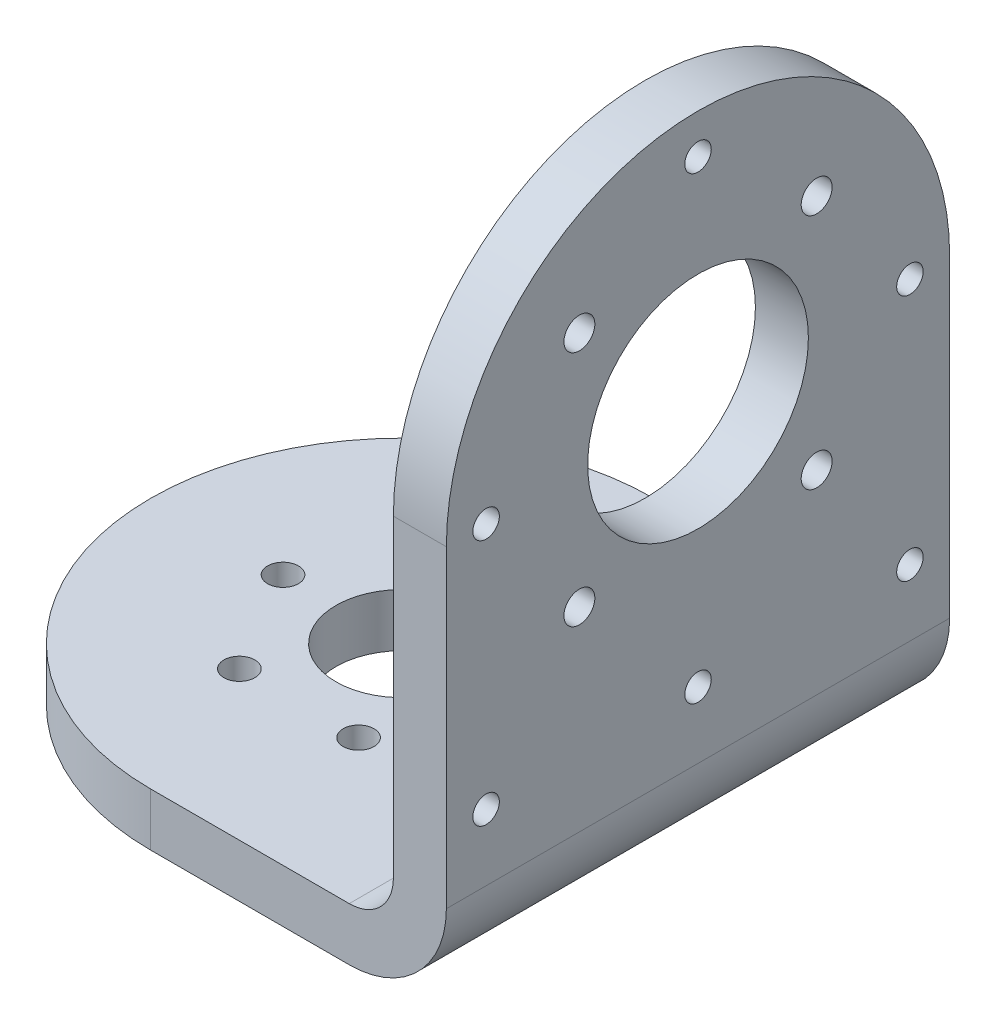
ISO-10303-21;
HEADER;
FILE_DESCRIPTION(('STEP AP214'),'2;1');
FILE_NAME('part.step','',(''),(''),'','','');
FILE_SCHEMA(('AUTOMOTIVE_DESIGN { 1 0 10303 214 1 1 1 1 }'));
ENDSEC;
DATA;
#1=APPLICATION_CONTEXT('core data for automotive mechanical design processes');
#2=APPLICATION_PROTOCOL_DEFINITION('international standard','automotive_design',2000,#1);
#3=PRODUCT_CONTEXT('',#1,'mechanical');
#4=PRODUCT('Part','Part','',(#3));
#5=PRODUCT_RELATED_PRODUCT_CATEGORY('part','',(#4));
#6=PRODUCT_DEFINITION_FORMATION('','',#4);
#7=PRODUCT_DEFINITION_CONTEXT('part definition',#1,'design');
#8=PRODUCT_DEFINITION('design','',#6,#7);
#9=PRODUCT_DEFINITION_SHAPE('','',#8);
#10=(LENGTH_UNIT() NAMED_UNIT(*) SI_UNIT(.MILLI.,.METRE.));
#11=(NAMED_UNIT(*) PLANE_ANGLE_UNIT() SI_UNIT($,.RADIAN.));
#12=(NAMED_UNIT(*) SI_UNIT($,.STERADIAN.) SOLID_ANGLE_UNIT());
#13=UNCERTAINTY_MEASURE_WITH_UNIT(LENGTH_MEASURE(1.E-05),#10,'distance_accuracy_value','');
#14=(GEOMETRIC_REPRESENTATION_CONTEXT(3) GLOBAL_UNCERTAINTY_ASSIGNED_CONTEXT((#13)) GLOBAL_UNIT_ASSIGNED_CONTEXT((#10,
#11,#12)) REPRESENTATION_CONTEXT('',''));
#15=CARTESIAN_POINT('',(0.,0.,0.));
#16=DIRECTION('',(0.,0.,1.));
#17=DIRECTION('',(1.,0.,0.));
#18=AXIS2_PLACEMENT_3D('',#15,#16,#17);
#19=CARTESIAN_POINT('',(0.,6.,0.));
#20=DIRECTION('',(0.,-1.,0.));
#21=DIRECTION('',(0.,0.,-1.));
#22=AXIS2_PLACEMENT_3D('',#19,#20,#21);
#23=CYLINDRICAL_SURFACE('',#22,28.5);
#24=CARTESIAN_POINT('',(0.,0.,0.));
#25=DIRECTION('',(0.,1.,0.));
#26=DIRECTION('',(0.,0.,1.));
#27=AXIS2_PLACEMENT_3D('',#24,#25,#26);
#28=CIRCLE('',#27,28.5);
#29=CARTESIAN_POINT('',(0.,0.,-28.5));
#30=VERTEX_POINT('',#29);
#31=CARTESIAN_POINT('',(0.,0.,28.5));
#32=VERTEX_POINT('',#31);
#33=EDGE_CURVE('E138',#30,#32,#28,.T.);
#34=ORIENTED_EDGE('',*,*,#33,.T.);
#35=DIRECTION('',(0.,-1.,0.));
#36=VECTOR('',#35,1.);
#37=CARTESIAN_POINT('',(0.,6.,28.5));
#38=LINE('',#37,#36);
#39=CARTESIAN_POINT('',(0.,6.,28.5));
#40=VERTEX_POINT('',#39);
#41=EDGE_CURVE('E161',#40,#32,#38,.T.);
#42=ORIENTED_EDGE('',*,*,#41,.F.);
#43=CARTESIAN_POINT('',(0.,6.,0.));
#44=DIRECTION('',(0.,1.,0.));
#45=DIRECTION('',(0.,0.,1.));
#46=AXIS2_PLACEMENT_3D('',#43,#44,#45);
#47=CIRCLE('',#46,28.5);
#48=CARTESIAN_POINT('',(0.,6.,-28.5));
#49=VERTEX_POINT('',#48);
#50=EDGE_CURVE('E140',#49,#40,#47,.T.);
#51=ORIENTED_EDGE('',*,*,#50,.F.);
#52=DIRECTION('',(0.,-1.,0.));
#53=VECTOR('',#52,1.);
#54=CARTESIAN_POINT('',(0.,6.,-28.5));
#55=LINE('',#54,#53);
#56=EDGE_CURVE('E149',#49,#30,#55,.T.);
#57=ORIENTED_EDGE('',*,*,#56,.T.);
#58=EDGE_LOOP('',(#34,#42,#51,#57));
#59=FACE_BOUND('',#58,.T.);
#60=ADVANCED_FACE('F41',(#59),#23,.T.);
#61=CARTESIAN_POINT('',(0.,6.,28.5));
#62=DIRECTION('',(0.,0.,-1.));
#63=DIRECTION('',(-1.,0.,0.));
#64=AXIS2_PLACEMENT_3D('',#61,#62,#63);
#65=PLANE('',#64);
#66=DIRECTION('',(1.,0.,0.));
#67=VECTOR('',#66,1.);
#68=CARTESIAN_POINT('',(0.,0.,28.5));
#69=LINE('',#68,#67);
#70=CARTESIAN_POINT('',(22.5,0.,28.5));
#71=VERTEX_POINT('',#70);
#72=EDGE_CURVE('E152',#32,#71,#69,.T.);
#73=ORIENTED_EDGE('',*,*,#72,.T.);
#74=CARTESIAN_POINT('',(22.5,11.,28.5));
#75=DIRECTION('',(0.,0.,-1.));
#76=DIRECTION('',(-1.,0.,0.));
#77=AXIS2_PLACEMENT_3D('',#74,#75,#76);
#78=CIRCLE('',#77,11.);
#79=CARTESIAN_POINT('',(33.5,11.,28.5));
#80=VERTEX_POINT('',#79);
#81=EDGE_CURVE('E65',#71,#80,#78,.F.);
#82=ORIENTED_EDGE('',*,*,#81,.T.);
#83=DIRECTION('',(0.,-1.,0.));
#84=VECTOR('',#83,1.);
#85=CARTESIAN_POINT('',(33.5,6.,28.5));
#86=LINE('',#85,#84);
#87=CARTESIAN_POINT('',(33.5,46.5,28.5));
#88=VERTEX_POINT('',#87);
#89=EDGE_CURVE('E159',#88,#80,#86,.T.);
#90=ORIENTED_EDGE('',*,*,#89,.F.);
#91=DIRECTION('',(1.,0.,0.));
#92=VECTOR('',#91,1.);
#93=CARTESIAN_POINT('',(27.5,46.5,28.5));
#94=LINE('',#93,#92);
#95=CARTESIAN_POINT('',(27.5,46.5,28.5));
#96=VERTEX_POINT('',#95);
#97=EDGE_CURVE('E126',#96,#88,#94,.T.);
#98=ORIENTED_EDGE('',*,*,#97,.F.);
#99=DIRECTION('',(0.,1.,0.));
#100=VECTOR('',#99,1.);
#101=CARTESIAN_POINT('',(27.5,0.,28.5));
#102=LINE('',#101,#100);
#103=CARTESIAN_POINT('',(27.5,11.,28.5));
#104=VERTEX_POINT('',#103);
#105=EDGE_CURVE('E127',#104,#96,#102,.T.);
#106=ORIENTED_EDGE('',*,*,#105,.F.);
#107=CARTESIAN_POINT('',(22.5,11.,28.5));
#108=DIRECTION('',(0.,0.,-1.));
#109=DIRECTION('',(-1.,0.,0.));
#110=AXIS2_PLACEMENT_3D('',#107,#108,#109);
#111=CIRCLE('',#110,5.);
#112=CARTESIAN_POINT('',(22.5,6.,28.5));
#113=VERTEX_POINT('',#112);
#114=EDGE_CURVE('E200',#104,#113,#111,.T.);
#115=ORIENTED_EDGE('',*,*,#114,.T.);
#116=DIRECTION('',(1.,0.,0.));
#117=VECTOR('',#116,1.);
#118=CARTESIAN_POINT('',(0.,6.,28.5));
#119=LINE('',#118,#117);
#120=EDGE_CURVE('E143',#40,#113,#119,.T.);
#121=ORIENTED_EDGE('',*,*,#120,.F.);
#122=ORIENTED_EDGE('',*,*,#41,.T.);
#123=EDGE_LOOP('',(#73,#82,#90,#98,#106,#115,#121,#122));
#124=FACE_BOUND('',#123,.T.);
#125=ADVANCED_FACE('F274',(#124),#65,.F.);
#126=CARTESIAN_POINT('',(33.5,6.,0.));
#127=DIRECTION('',(1.,0.,0.));
#128=DIRECTION('',(0.,0.,-1.));
#129=AXIS2_PLACEMENT_3D('',#126,#127,#128);
#130=PLANE('',#129);
#131=CARTESIAN_POINT('',(33.5,70.5,0.));
#132=DIRECTION('',(1.,0.,0.));
#133=DIRECTION('',(0.,0.,-1.));
#134=AXIS2_PLACEMENT_3D('',#131,#132,#133);
#135=CIRCLE('',#134,1.5);
#136=CARTESIAN_POINT('',(33.5,70.5,-1.5));
#137=VERTEX_POINT('',#136);
#138=EDGE_CURVE('E212',#137,#137,#135,.T.);
#139=ORIENTED_EDGE('',*,*,#138,.F.);
#140=EDGE_LOOP('',(#139));
#141=FACE_BOUND('',#140,.T.);
#142=CARTESIAN_POINT('',(33.5,18.5,0.));
#143=DIRECTION('',(1.,0.,0.));
#144=DIRECTION('',(0.,0.,-1.));
#145=AXIS2_PLACEMENT_3D('',#142,#143,#144);
#146=CIRCLE('',#145,1.5);
#147=CARTESIAN_POINT('',(33.5,18.5,-1.5));
#148=VERTEX_POINT('',#147);
#149=EDGE_CURVE('E352',#148,#148,#146,.T.);
#150=ORIENTED_EDGE('',*,*,#149,.F.);
#151=EDGE_LOOP('',(#150));
#152=FACE_BOUND('',#151,.T.);
#153=CARTESIAN_POINT('',(33.5,46.5,0.));
#154=DIRECTION('',(1.,0.,0.));
#155=DIRECTION('',(0.,0.,-1.));
#156=AXIS2_PLACEMENT_3D('',#153,#154,#155);
#157=CIRCLE('',#156,12.5);
#158=CARTESIAN_POINT('',(33.5,46.5,-12.5));
#159=VERTEX_POINT('',#158);
#160=EDGE_CURVE('E356',#159,#159,#157,.T.);
#161=ORIENTED_EDGE('',*,*,#160,.F.);
#162=EDGE_LOOP('',(#161));
#163=FACE_BOUND('',#162,.T.);
#164=CARTESIAN_POINT('',(33.5,18.5,-24.));
#165=DIRECTION('',(1.,0.,0.));
#166=DIRECTION('',(0.,0.,-1.));
#167=AXIS2_PLACEMENT_3D('',#164,#165,#166);
#168=CIRCLE('',#167,1.5);
#169=CARTESIAN_POINT('',(33.5,18.5,-25.5));
#170=VERTEX_POINT('',#169);
#171=EDGE_CURVE('E360',#170,#170,#168,.T.);
#172=ORIENTED_EDGE('',*,*,#171,.F.);
#173=EDGE_LOOP('',(#172));
#174=FACE_BOUND('',#173,.T.);
#175=CARTESIAN_POINT('',(33.5,18.5,24.));
#176=DIRECTION('',(1.,0.,0.));
#177=DIRECTION('',(0.,0.,-1.));
#178=AXIS2_PLACEMENT_3D('',#175,#176,#177);
#179=CIRCLE('',#178,1.5);
#180=CARTESIAN_POINT('',(33.5,18.5,22.5));
#181=VERTEX_POINT('',#180);
#182=EDGE_CURVE('E364',#181,#181,#179,.T.);
#183=ORIENTED_EDGE('',*,*,#182,.F.);
#184=EDGE_LOOP('',(#183));
#185=FACE_BOUND('',#184,.T.);
#186=CARTESIAN_POINT('',(33.5,46.5,-24.));
#187=DIRECTION('',(1.,0.,0.));
#188=DIRECTION('',(0.,0.,-1.));
#189=AXIS2_PLACEMENT_3D('',#186,#187,#188);
#190=CIRCLE('',#189,1.5);
#191=CARTESIAN_POINT('',(33.5,46.5,-25.5));
#192=VERTEX_POINT('',#191);
#193=EDGE_CURVE('E368',#192,#192,#190,.T.);
#194=ORIENTED_EDGE('',*,*,#193,.F.);
#195=EDGE_LOOP('',(#194));
#196=FACE_BOUND('',#195,.T.);
#197=CARTESIAN_POINT('',(33.5,46.5,24.));
#198=DIRECTION('',(1.,0.,0.));
#199=DIRECTION('',(0.,0.,-1.));
#200=AXIS2_PLACEMENT_3D('',#197,#198,#199);
#201=CIRCLE('',#200,1.5);
#202=CARTESIAN_POINT('',(33.5,46.5,22.5));
#203=VERTEX_POINT('',#202);
#204=EDGE_CURVE('E372',#203,#203,#201,.T.);
#205=ORIENTED_EDGE('',*,*,#204,.F.);
#206=EDGE_LOOP('',(#205));
#207=FACE_BOUND('',#206,.T.);
#208=CARTESIAN_POINT('',(33.5,33.0649711574556,13.4350288425444));
#209=DIRECTION('',(1.,0.,0.));
#210=DIRECTION('',(0.,0.,-1.));
#211=AXIS2_PLACEMENT_3D('',#208,#209,#210);
#212=CIRCLE('',#211,1.75000000000001);
#213=CARTESIAN_POINT('',(33.5,33.0649711574556,11.6850288425444));
#214=VERTEX_POINT('',#213);
#215=EDGE_CURVE('E228',#214,#214,#212,.T.);
#216=ORIENTED_EDGE('',*,*,#215,.F.);
#217=EDGE_LOOP('',(#216));
#218=FACE_BOUND('',#217,.T.);
#219=CARTESIAN_POINT('',(33.5,33.0649711574556,-13.4350288425444));
#220=DIRECTION('',(1.,0.,0.));
#221=DIRECTION('',(0.,0.,-1.));
#222=AXIS2_PLACEMENT_3D('',#219,#220,#221);
#223=CIRCLE('',#222,1.75);
#224=CARTESIAN_POINT('',(33.5,33.0649711574556,-15.1850288425444));
#225=VERTEX_POINT('',#224);
#226=EDGE_CURVE('E232',#225,#225,#223,.T.);
#227=ORIENTED_EDGE('',*,*,#226,.F.);
#228=EDGE_LOOP('',(#227));
#229=FACE_BOUND('',#228,.T.);
#230=CARTESIAN_POINT('',(33.5,59.9350288425444,-13.4350288425444));
#231=DIRECTION('',(1.,0.,0.));
#232=DIRECTION('',(0.,0.,-1.));
#233=AXIS2_PLACEMENT_3D('',#230,#231,#232);
#234=CIRCLE('',#233,1.75000000000001);
#235=CARTESIAN_POINT('',(33.5,59.9350288425444,-15.1850288425444));
#236=VERTEX_POINT('',#235);
#237=EDGE_CURVE('E237',#236,#236,#234,.T.);
#238=ORIENTED_EDGE('',*,*,#237,.F.);
#239=EDGE_LOOP('',(#238));
#240=FACE_BOUND('',#239,.T.);
#241=CARTESIAN_POINT('',(33.5,59.9350288425444,13.4350288425444));
#242=DIRECTION('',(1.,0.,0.));
#243=DIRECTION('',(0.,0.,-1.));
#244=AXIS2_PLACEMENT_3D('',#241,#242,#243);
#245=CIRCLE('',#244,1.74999999999997);
#246=CARTESIAN_POINT('',(33.5,59.9350288425444,11.6850288425444));
#247=VERTEX_POINT('',#246);
#248=EDGE_CURVE('E187',#247,#247,#245,.T.);
#249=ORIENTED_EDGE('',*,*,#248,.F.);
#250=EDGE_LOOP('',(#249));
#251=FACE_BOUND('',#250,.T.);
#252=ORIENTED_EDGE('',*,*,#89,.T.);
#253=DIRECTION('',(0.,0.,1.));
#254=VECTOR('',#253,1.);
#255=CARTESIAN_POINT('',(33.5,11.,-28.5));
#256=LINE('',#255,#254);
#257=CARTESIAN_POINT('',(33.5,11.,-28.5));
#258=VERTEX_POINT('',#257);
#259=EDGE_CURVE('E50',#80,#258,#256,.F.);
#260=ORIENTED_EDGE('',*,*,#259,.T.);
#261=DIRECTION('',(0.,-1.,0.));
#262=VECTOR('',#261,1.);
#263=CARTESIAN_POINT('',(33.5,6.,-28.5));
#264=LINE('',#263,#262);
#265=CARTESIAN_POINT('',(33.5,46.5,-28.5));
#266=VERTEX_POINT('',#265);
#267=EDGE_CURVE('E157',#266,#258,#264,.T.);
#268=ORIENTED_EDGE('',*,*,#267,.F.);
#269=CARTESIAN_POINT('',(33.5,46.5,0.));
#270=DIRECTION('',(1.,0.,0.));
#271=DIRECTION('',(0.,0.,-1.));
#272=AXIS2_PLACEMENT_3D('',#269,#270,#271);
#273=CIRCLE('',#272,28.5);
#274=EDGE_CURVE('E119',#266,#88,#273,.T.);
#275=ORIENTED_EDGE('',*,*,#274,.T.);
#276=EDGE_LOOP('',(#252,#260,#268,#275));
#277=FACE_BOUND('',#276,.T.);
#278=ADVANCED_FACE('F275',(#141,#152,#163,#174,#185,#196,#207,#218,#229,#240,#251,#277),#130,.T.);
#279=CARTESIAN_POINT('',(0.,6.,-28.5));
#280=DIRECTION('',(0.,0.,-1.));
#281=DIRECTION('',(-1.,0.,0.));
#282=AXIS2_PLACEMENT_3D('',#279,#280,#281);
#283=PLANE('',#282);
#284=ORIENTED_EDGE('',*,*,#267,.T.);
#285=CARTESIAN_POINT('',(22.5,11.,-28.5));
#286=DIRECTION('',(0.,0.,-1.));
#287=DIRECTION('',(-1.,0.,0.));
#288=AXIS2_PLACEMENT_3D('',#285,#286,#287);
#289=CIRCLE('',#288,11.);
#290=CARTESIAN_POINT('',(22.5,0.,-28.5));
#291=VERTEX_POINT('',#290);
#292=EDGE_CURVE('E11',#258,#291,#289,.T.);
#293=ORIENTED_EDGE('',*,*,#292,.T.);
#294=DIRECTION('',(1.,0.,0.));
#295=VECTOR('',#294,1.);
#296=CARTESIAN_POINT('',(0.,0.,-28.5));
#297=LINE('',#296,#295);
#298=EDGE_CURVE('E144',#30,#291,#297,.T.);
#299=ORIENTED_EDGE('',*,*,#298,.F.);
#300=ORIENTED_EDGE('',*,*,#56,.F.);
#301=DIRECTION('',(1.,0.,0.));
#302=VECTOR('',#301,1.);
#303=CARTESIAN_POINT('',(0.,6.,-28.5));
#304=LINE('',#303,#302);
#305=CARTESIAN_POINT('',(22.5,6.,-28.5));
#306=VERTEX_POINT('',#305);
#307=EDGE_CURVE('E147',#49,#306,#304,.T.);
#308=ORIENTED_EDGE('',*,*,#307,.T.);
#309=CARTESIAN_POINT('',(22.5,11.,-28.5));
#310=DIRECTION('',(0.,0.,-1.));
#311=DIRECTION('',(-1.,0.,0.));
#312=AXIS2_PLACEMENT_3D('',#309,#310,#311);
#313=CIRCLE('',#312,5.);
#314=CARTESIAN_POINT('',(27.5,11.,-28.5));
#315=VERTEX_POINT('',#314);
#316=EDGE_CURVE('E113',#306,#315,#313,.F.);
#317=ORIENTED_EDGE('',*,*,#316,.T.);
#318=DIRECTION('',(0.,1.,0.));
#319=VECTOR('',#318,1.);
#320=CARTESIAN_POINT('',(27.5,0.,-28.5));
#321=LINE('',#320,#319);
#322=CARTESIAN_POINT('',(27.5,46.5,-28.5));
#323=VERTEX_POINT('',#322);
#324=EDGE_CURVE('E106',#315,#323,#321,.T.);
#325=ORIENTED_EDGE('',*,*,#324,.T.);
#326=DIRECTION('',(1.,0.,0.));
#327=VECTOR('',#326,1.);
#328=CARTESIAN_POINT('',(27.5,46.5,-28.5));
#329=LINE('',#328,#327);
#330=EDGE_CURVE('E109',#323,#266,#329,.T.);
#331=ORIENTED_EDGE('',*,*,#330,.T.);
#332=EDGE_LOOP('',(#284,#293,#299,#300,#308,#317,#325,#331));
#333=FACE_BOUND('',#332,.T.);
#334=ADVANCED_FACE('F108',(#333),#283,.T.);
#335=CARTESIAN_POINT('',(0.,6.,0.));
#336=DIRECTION('',(0.,1.,0.));
#337=DIRECTION('',(0.,0.,1.));
#338=AXIS2_PLACEMENT_3D('',#335,#336,#337);
#339=PLANE('',#338);
#340=CARTESIAN_POINT('',(0.,6.,0.));
#341=DIRECTION('',(0.,1.,0.));
#342=DIRECTION('',(0.,0.,1.));
#343=AXIS2_PLACEMENT_3D('',#340,#341,#342);
#344=CIRCLE('',#343,7.5);
#345=CARTESIAN_POINT('',(0.,6.,7.5));
#346=VERTEX_POINT('',#345);
#347=EDGE_CURVE('E392',#346,#346,#344,.T.);
#348=ORIENTED_EDGE('',*,*,#347,.F.);
#349=EDGE_LOOP('',(#348));
#350=FACE_BOUND('',#349,.T.);
#351=CARTESIAN_POINT('',(-13.5,6.,0.));
#352=DIRECTION('',(0.,1.,0.));
#353=DIRECTION('',(0.,0.,1.));
#354=AXIS2_PLACEMENT_3D('',#351,#352,#353);
#355=CIRCLE('',#354,1.75);
#356=CARTESIAN_POINT('',(-13.5,6.,1.75));
#357=VERTEX_POINT('',#356);
#358=EDGE_CURVE('E196',#357,#357,#355,.T.);
#359=ORIENTED_EDGE('',*,*,#358,.F.);
#360=EDGE_LOOP('',(#359));
#361=FACE_BOUND('',#360,.T.);
#362=CARTESIAN_POINT('',(-6.75000000000014,6.,11.6913429510898));
#363=DIRECTION('',(0.,1.,0.));
#364=DIRECTION('',(0.,0.,1.));
#365=AXIS2_PLACEMENT_3D('',#362,#363,#364);
#366=CIRCLE('',#365,1.75);
#367=CARTESIAN_POINT('',(-6.75000000000014,6.,13.4413429510898));
#368=VERTEX_POINT('',#367);
#369=EDGE_CURVE('E252',#368,#368,#366,.T.);
#370=ORIENTED_EDGE('',*,*,#369,.F.);
#371=EDGE_LOOP('',(#370));
#372=FACE_BOUND('',#371,.T.);
#373=CARTESIAN_POINT('',(6.74999999999989,6.,11.69134295109));
#374=DIRECTION('',(0.,1.,0.));
#375=DIRECTION('',(0.,0.,1.));
#376=AXIS2_PLACEMENT_3D('',#373,#374,#375);
#377=CIRCLE('',#376,1.75);
#378=CARTESIAN_POINT('',(6.74999999999989,6.,13.44134295109));
#379=VERTEX_POINT('',#378);
#380=EDGE_CURVE('E249',#379,#379,#377,.T.);
#381=ORIENTED_EDGE('',*,*,#380,.F.);
#382=EDGE_LOOP('',(#381));
#383=FACE_BOUND('',#382,.T.);
#384=CARTESIAN_POINT('',(13.5,6.,0.));
#385=DIRECTION('',(0.,1.,0.));
#386=DIRECTION('',(0.,0.,1.));
#387=AXIS2_PLACEMENT_3D('',#384,#385,#386);
#388=CIRCLE('',#387,1.75);
#389=CARTESIAN_POINT('',(13.5,6.,1.75000000000009));
#390=VERTEX_POINT('',#389);
#391=EDGE_CURVE('E246',#390,#390,#388,.T.);
#392=ORIENTED_EDGE('',*,*,#391,.F.);
#393=EDGE_LOOP('',(#392));
#394=FACE_BOUND('',#393,.T.);
#395=CARTESIAN_POINT('',(6.75000000000005,6.,-11.6913429510899));
#396=DIRECTION('',(0.,1.,0.));
#397=DIRECTION('',(0.,0.,1.));
#398=AXIS2_PLACEMENT_3D('',#395,#396,#397);
#399=CIRCLE('',#398,1.75);
#400=CARTESIAN_POINT('',(6.75000000000005,6.,-9.94134295108989));
#401=VERTEX_POINT('',#400);
#402=EDGE_CURVE('E243',#401,#401,#399,.T.);
#403=ORIENTED_EDGE('',*,*,#402,.F.);
#404=EDGE_LOOP('',(#403));
#405=FACE_BOUND('',#404,.T.);
#406=CARTESIAN_POINT('',(-6.74999999999997,6.,-11.6913429510899));
#407=DIRECTION('',(0.,1.,0.));
#408=DIRECTION('',(0.,0.,1.));
#409=AXIS2_PLACEMENT_3D('',#406,#407,#408);
#410=CIRCLE('',#409,1.75);
#411=CARTESIAN_POINT('',(-6.74999999999997,6.,-9.94134295108994));
#412=VERTEX_POINT('',#411);
#413=EDGE_CURVE('E169',#412,#412,#410,.T.);
#414=ORIENTED_EDGE('',*,*,#413,.F.);
#415=EDGE_LOOP('',(#414));
#416=FACE_BOUND('',#415,.T.);
#417=ORIENTED_EDGE('',*,*,#120,.T.);
#418=DIRECTION('',(0.,0.,1.));
#419=VECTOR('',#418,1.);
#420=CARTESIAN_POINT('',(22.5,6.,0.));
#421=LINE('',#420,#419);
#422=EDGE_CURVE('E198',#113,#306,#421,.F.);
#423=ORIENTED_EDGE('',*,*,#422,.T.);
#424=ORIENTED_EDGE('',*,*,#307,.F.);
#425=ORIENTED_EDGE('',*,*,#50,.T.);
#426=EDGE_LOOP('',(#417,#423,#424,#425));
#427=FACE_BOUND('',#426,.T.);
#428=ADVANCED_FACE('F262',(#350,#361,#372,#383,#394,#405,#416,#427),#339,.T.);
#429=CARTESIAN_POINT('',(0.,0.,0.));
#430=DIRECTION('',(0.,1.,0.));
#431=DIRECTION('',(0.,0.,1.));
#432=AXIS2_PLACEMENT_3D('',#429,#430,#431);
#433=PLANE('',#432);
#434=CARTESIAN_POINT('',(0.,0.,0.));
#435=DIRECTION('',(0.,1.,0.));
#436=DIRECTION('',(0.,0.,1.));
#437=AXIS2_PLACEMENT_3D('',#434,#435,#436);
#438=CIRCLE('',#437,7.5);
#439=CARTESIAN_POINT('',(0.,0.,7.5));
#440=VERTEX_POINT('',#439);
#441=EDGE_CURVE('E45',#440,#440,#438,.T.);
#442=ORIENTED_EDGE('',*,*,#441,.T.);
#443=EDGE_LOOP('',(#442));
#444=FACE_BOUND('',#443,.T.);
#445=CARTESIAN_POINT('',(-13.5,0.,0.));
#446=DIRECTION('',(0.,1.,0.));
#447=DIRECTION('',(0.,0.,1.));
#448=AXIS2_PLACEMENT_3D('',#445,#446,#447);
#449=CIRCLE('',#448,1.75);
#450=CARTESIAN_POINT('',(-13.5,0.,1.75));
#451=VERTEX_POINT('',#450);
#452=EDGE_CURVE('E137',#451,#451,#449,.T.);
#453=ORIENTED_EDGE('',*,*,#452,.T.);
#454=EDGE_LOOP('',(#453));
#455=FACE_BOUND('',#454,.T.);
#456=CARTESIAN_POINT('',(-6.75000000000014,0.,11.6913429510898));
#457=DIRECTION('',(0.,1.,0.));
#458=DIRECTION('',(0.,0.,1.));
#459=AXIS2_PLACEMENT_3D('',#456,#457,#458);
#460=CIRCLE('',#459,1.75);
#461=CARTESIAN_POINT('',(-6.75000000000014,0.,13.4413429510898));
#462=VERTEX_POINT('',#461);
#463=EDGE_CURVE('E178',#462,#462,#460,.T.);
#464=ORIENTED_EDGE('',*,*,#463,.T.);
#465=EDGE_LOOP('',(#464));
#466=FACE_BOUND('',#465,.T.);
#467=CARTESIAN_POINT('',(6.74999999999989,0.,11.69134295109));
#468=DIRECTION('',(0.,1.,0.));
#469=DIRECTION('',(0.,0.,1.));
#470=AXIS2_PLACEMENT_3D('',#467,#468,#469);
#471=CIRCLE('',#470,1.75);
#472=CARTESIAN_POINT('',(6.74999999999989,0.,13.44134295109));
#473=VERTEX_POINT('',#472);
#474=EDGE_CURVE('E175',#473,#473,#471,.T.);
#475=ORIENTED_EDGE('',*,*,#474,.T.);
#476=EDGE_LOOP('',(#475));
#477=FACE_BOUND('',#476,.T.);
#478=CARTESIAN_POINT('',(13.5,0.,0.));
#479=DIRECTION('',(0.,1.,0.));
#480=DIRECTION('',(0.,0.,1.));
#481=AXIS2_PLACEMENT_3D('',#478,#479,#480);
#482=CIRCLE('',#481,1.75);
#483=CARTESIAN_POINT('',(13.5,0.,1.75000000000009));
#484=VERTEX_POINT('',#483);
#485=EDGE_CURVE('E172',#484,#484,#482,.T.);
#486=ORIENTED_EDGE('',*,*,#485,.T.);
#487=EDGE_LOOP('',(#486));
#488=FACE_BOUND('',#487,.T.);
#489=CARTESIAN_POINT('',(6.75000000000005,0.,-11.6913429510899));
#490=DIRECTION('',(0.,1.,0.));
#491=DIRECTION('',(0.,0.,1.));
#492=AXIS2_PLACEMENT_3D('',#489,#490,#491);
#493=CIRCLE('',#492,1.75);
#494=CARTESIAN_POINT('',(6.75000000000005,0.,-9.94134295108989));
#495=VERTEX_POINT('',#494);
#496=EDGE_CURVE('E168',#495,#495,#493,.T.);
#497=ORIENTED_EDGE('',*,*,#496,.T.);
#498=EDGE_LOOP('',(#497));
#499=FACE_BOUND('',#498,.T.);
#500=CARTESIAN_POINT('',(-6.74999999999997,0.,-11.6913429510899));
#501=DIRECTION('',(0.,1.,0.));
#502=DIRECTION('',(0.,0.,1.));
#503=AXIS2_PLACEMENT_3D('',#500,#501,#502);
#504=CIRCLE('',#503,1.75);
#505=CARTESIAN_POINT('',(-6.74999999999997,0.,-9.94134295108994));
#506=VERTEX_POINT('',#505);
#507=EDGE_CURVE('E165',#506,#506,#504,.T.);
#508=ORIENTED_EDGE('',*,*,#507,.T.);
#509=EDGE_LOOP('',(#508));
#510=FACE_BOUND('',#509,.T.);
#511=ORIENTED_EDGE('',*,*,#298,.T.);
#512=DIRECTION('',(0.,0.,1.));
#513=VECTOR('',#512,1.);
#514=CARTESIAN_POINT('',(22.5,0.,28.5));
#515=LINE('',#514,#513);
#516=EDGE_CURVE('E203',#291,#71,#515,.T.);
#517=ORIENTED_EDGE('',*,*,#516,.T.);
#518=ORIENTED_EDGE('',*,*,#72,.F.);
#519=ORIENTED_EDGE('',*,*,#33,.F.);
#520=EDGE_LOOP('',(#511,#517,#518,#519));
#521=FACE_BOUND('',#520,.T.);
#522=ADVANCED_FACE('F265',(#444,#455,#466,#477,#488,#499,#510,#521),#433,.F.);
#523=CARTESIAN_POINT('',(27.5,46.5,0.));
#524=DIRECTION('',(1.,0.,0.));
#525=DIRECTION('',(0.,0.,-1.));
#526=AXIS2_PLACEMENT_3D('',#523,#524,#525);
#527=CYLINDRICAL_SURFACE('',#526,28.5);
#528=ORIENTED_EDGE('',*,*,#274,.F.);
#529=ORIENTED_EDGE('',*,*,#330,.F.);
#530=CARTESIAN_POINT('',(27.5,46.5,0.));
#531=DIRECTION('',(1.,0.,0.));
#532=DIRECTION('',(0.,0.,-1.));
#533=AXIS2_PLACEMENT_3D('',#530,#531,#532);
#534=CIRCLE('',#533,28.5);
#535=EDGE_CURVE('E118',#323,#96,#534,.T.);
#536=ORIENTED_EDGE('',*,*,#535,.T.);
#537=ORIENTED_EDGE('',*,*,#97,.T.);
#538=EDGE_LOOP('',(#528,#529,#536,#537));
#539=FACE_BOUND('',#538,.T.);
#540=ADVANCED_FACE('F123',(#539),#527,.T.);
#541=CARTESIAN_POINT('',(27.5,0.,0.));
#542=DIRECTION('',(1.,0.,0.));
#543=DIRECTION('',(0.,0.,-1.));
#544=AXIS2_PLACEMENT_3D('',#541,#542,#543);
#545=PLANE('',#544);
#546=CARTESIAN_POINT('',(27.5,70.5,0.));
#547=DIRECTION('',(1.,0.,0.));
#548=DIRECTION('',(0.,0.,-1.));
#549=AXIS2_PLACEMENT_3D('',#546,#547,#548);
#550=CIRCLE('',#549,1.5);
#551=CARTESIAN_POINT('',(27.5,70.5,-1.5));
#552=VERTEX_POINT('',#551);
#553=EDGE_CURVE('E226',#552,#552,#550,.T.);
#554=ORIENTED_EDGE('',*,*,#553,.T.);
#555=EDGE_LOOP('',(#554));
#556=FACE_BOUND('',#555,.T.);
#557=CARTESIAN_POINT('',(27.5,18.5,0.));
#558=DIRECTION('',(1.,0.,0.));
#559=DIRECTION('',(0.,0.,-1.));
#560=AXIS2_PLACEMENT_3D('',#557,#558,#559);
#561=CIRCLE('',#560,1.5);
#562=CARTESIAN_POINT('',(27.5,18.5,-1.5));
#563=VERTEX_POINT('',#562);
#564=EDGE_CURVE('E224',#563,#563,#561,.T.);
#565=ORIENTED_EDGE('',*,*,#564,.T.);
#566=EDGE_LOOP('',(#565));
#567=FACE_BOUND('',#566,.T.);
#568=CARTESIAN_POINT('',(27.5,46.5,0.));
#569=DIRECTION('',(1.,0.,0.));
#570=DIRECTION('',(0.,0.,-1.));
#571=AXIS2_PLACEMENT_3D('',#568,#569,#570);
#572=CIRCLE('',#571,12.5);
#573=CARTESIAN_POINT('',(27.5,46.5,-12.5));
#574=VERTEX_POINT('',#573);
#575=EDGE_CURVE('E221',#574,#574,#572,.T.);
#576=ORIENTED_EDGE('',*,*,#575,.T.);
#577=EDGE_LOOP('',(#576));
#578=FACE_BOUND('',#577,.T.);
#579=CARTESIAN_POINT('',(27.5,18.5,-24.));
#580=DIRECTION('',(1.,0.,0.));
#581=DIRECTION('',(0.,0.,-1.));
#582=AXIS2_PLACEMENT_3D('',#579,#580,#581);
#583=CIRCLE('',#582,1.5);
#584=CARTESIAN_POINT('',(27.5,18.5,-25.5));
#585=VERTEX_POINT('',#584);
#586=EDGE_CURVE('E218',#585,#585,#583,.T.);
#587=ORIENTED_EDGE('',*,*,#586,.T.);
#588=EDGE_LOOP('',(#587));
#589=FACE_BOUND('',#588,.T.);
#590=CARTESIAN_POINT('',(27.5,18.5,24.));
#591=DIRECTION('',(1.,0.,0.));
#592=DIRECTION('',(0.,0.,-1.));
#593=AXIS2_PLACEMENT_3D('',#590,#591,#592);
#594=CIRCLE('',#593,1.5);
#595=CARTESIAN_POINT('',(27.5,18.5,22.5));
#596=VERTEX_POINT('',#595);
#597=EDGE_CURVE('E215',#596,#596,#594,.T.);
#598=ORIENTED_EDGE('',*,*,#597,.T.);
#599=EDGE_LOOP('',(#598));
#600=FACE_BOUND('',#599,.T.);
#601=CARTESIAN_POINT('',(27.5,46.5,-24.));
#602=DIRECTION('',(1.,0.,0.));
#603=DIRECTION('',(0.,0.,-1.));
#604=AXIS2_PLACEMENT_3D('',#601,#602,#603);
#605=CIRCLE('',#604,1.5);
#606=CARTESIAN_POINT('',(27.5,46.5,-25.5));
#607=VERTEX_POINT('',#606);
#608=EDGE_CURVE('E211',#607,#607,#605,.T.);
#609=ORIENTED_EDGE('',*,*,#608,.T.);
#610=EDGE_LOOP('',(#609));
#611=FACE_BOUND('',#610,.T.);
#612=CARTESIAN_POINT('',(27.5,46.5,24.));
#613=DIRECTION('',(1.,0.,0.));
#614=DIRECTION('',(0.,0.,-1.));
#615=AXIS2_PLACEMENT_3D('',#612,#613,#614);
#616=CIRCLE('',#615,1.5);
#617=CARTESIAN_POINT('',(27.5,46.5,22.5));
#618=VERTEX_POINT('',#617);
#619=EDGE_CURVE('E208',#618,#618,#616,.T.);
#620=ORIENTED_EDGE('',*,*,#619,.T.);
#621=EDGE_LOOP('',(#620));
#622=FACE_BOUND('',#621,.T.);
#623=CARTESIAN_POINT('',(27.5,33.0649711574556,13.4350288425444));
#624=DIRECTION('',(1.,0.,0.));
#625=DIRECTION('',(0.,0.,-1.));
#626=AXIS2_PLACEMENT_3D('',#623,#624,#625);
#627=CIRCLE('',#626,1.75000000000001);
#628=CARTESIAN_POINT('',(27.5,33.0649711574556,11.6850288425444));
#629=VERTEX_POINT('',#628);
#630=EDGE_CURVE('E193',#629,#629,#627,.T.);
#631=ORIENTED_EDGE('',*,*,#630,.T.);
#632=EDGE_LOOP('',(#631));
#633=FACE_BOUND('',#632,.T.);
#634=CARTESIAN_POINT('',(27.5,33.0649711574556,-13.4350288425444));
#635=DIRECTION('',(1.,0.,0.));
#636=DIRECTION('',(0.,0.,-1.));
#637=AXIS2_PLACEMENT_3D('',#634,#635,#636);
#638=CIRCLE('',#637,1.75);
#639=CARTESIAN_POINT('',(27.5,33.0649711574556,-15.1850288425444));
#640=VERTEX_POINT('',#639);
#641=EDGE_CURVE('E190',#640,#640,#638,.T.);
#642=ORIENTED_EDGE('',*,*,#641,.T.);
#643=EDGE_LOOP('',(#642));
#644=FACE_BOUND('',#643,.T.);
#645=CARTESIAN_POINT('',(27.5,59.9350288425444,-13.4350288425444));
#646=DIRECTION('',(1.,0.,0.));
#647=DIRECTION('',(0.,0.,-1.));
#648=AXIS2_PLACEMENT_3D('',#645,#646,#647);
#649=CIRCLE('',#648,1.75000000000001);
#650=CARTESIAN_POINT('',(27.5,59.9350288425444,-15.1850288425444));
#651=VERTEX_POINT('',#650);
#652=EDGE_CURVE('E186',#651,#651,#649,.T.);
#653=ORIENTED_EDGE('',*,*,#652,.T.);
#654=EDGE_LOOP('',(#653));
#655=FACE_BOUND('',#654,.T.);
#656=CARTESIAN_POINT('',(27.5,59.9350288425444,13.4350288425444));
#657=DIRECTION('',(1.,0.,0.));
#658=DIRECTION('',(0.,0.,-1.));
#659=AXIS2_PLACEMENT_3D('',#656,#657,#658);
#660=CIRCLE('',#659,1.74999999999997);
#661=CARTESIAN_POINT('',(27.5,59.9350288425444,11.6850288425444));
#662=VERTEX_POINT('',#661);
#663=EDGE_CURVE('E183',#662,#662,#660,.T.);
#664=ORIENTED_EDGE('',*,*,#663,.T.);
#665=EDGE_LOOP('',(#664));
#666=FACE_BOUND('',#665,.T.);
#667=ORIENTED_EDGE('',*,*,#324,.F.);
#668=DIRECTION('',(0.,0.,1.));
#669=VECTOR('',#668,1.);
#670=CARTESIAN_POINT('',(27.5,11.,0.));
#671=LINE('',#670,#669);
#672=EDGE_CURVE('E164',#315,#104,#671,.T.);
#673=ORIENTED_EDGE('',*,*,#672,.T.);
#674=ORIENTED_EDGE('',*,*,#105,.T.);
#675=ORIENTED_EDGE('',*,*,#535,.F.);
#676=EDGE_LOOP('',(#667,#673,#674,#675));
#677=FACE_BOUND('',#676,.T.);
#678=ADVANCED_FACE('F129',(#556,#567,#578,#589,#600,#611,#622,#633,#644,#655,#666,#677),#545,.F.);
#679=CARTESIAN_POINT('',(-6.74999999999997,-10.,-11.6913429510899));
#680=DIRECTION('',(0.,1.,0.));
#681=DIRECTION('',(0.,0.,1.));
#682=AXIS2_PLACEMENT_3D('',#679,#680,#681);
#683=CYLINDRICAL_SURFACE('',#682,1.75);
#684=ORIENTED_EDGE('',*,*,#413,.T.);
#685=EDGE_LOOP('',(#684));
#686=FACE_BOUND('',#685,.T.);
#687=ORIENTED_EDGE('',*,*,#507,.F.);
#688=EDGE_LOOP('',(#687));
#689=FACE_BOUND('',#688,.T.);
#690=ADVANCED_FACE('F259',(#686,#689),#683,.F.);
#691=CARTESIAN_POINT('',(6.75000000000005,-10.,-11.6913429510899));
#692=DIRECTION('',(0.,1.,0.));
#693=DIRECTION('',(0.,0.,1.));
#694=AXIS2_PLACEMENT_3D('',#691,#692,#693);
#695=CYLINDRICAL_SURFACE('',#694,1.75);
#696=ORIENTED_EDGE('',*,*,#402,.T.);
#697=EDGE_LOOP('',(#696));
#698=FACE_BOUND('',#697,.T.);
#699=ORIENTED_EDGE('',*,*,#496,.F.);
#700=EDGE_LOOP('',(#699));
#701=FACE_BOUND('',#700,.T.);
#702=ADVANCED_FACE('F313',(#698,#701),#695,.F.);
#703=CARTESIAN_POINT('',(13.5,-10.,0.));
#704=DIRECTION('',(0.,1.,0.));
#705=DIRECTION('',(0.,0.,1.));
#706=AXIS2_PLACEMENT_3D('',#703,#704,#705);
#707=CYLINDRICAL_SURFACE('',#706,1.75);
#708=ORIENTED_EDGE('',*,*,#391,.T.);
#709=EDGE_LOOP('',(#708));
#710=FACE_BOUND('',#709,.T.);
#711=ORIENTED_EDGE('',*,*,#485,.F.);
#712=EDGE_LOOP('',(#711));
#713=FACE_BOUND('',#712,.T.);
#714=ADVANCED_FACE('F316',(#710,#713),#707,.F.);
#715=CARTESIAN_POINT('',(6.74999999999989,-10.,11.69134295109));
#716=DIRECTION('',(0.,1.,0.));
#717=DIRECTION('',(0.,0.,1.));
#718=AXIS2_PLACEMENT_3D('',#715,#716,#717);
#719=CYLINDRICAL_SURFACE('',#718,1.75);
#720=ORIENTED_EDGE('',*,*,#380,.T.);
#721=EDGE_LOOP('',(#720));
#722=FACE_BOUND('',#721,.T.);
#723=ORIENTED_EDGE('',*,*,#474,.F.);
#724=EDGE_LOOP('',(#723));
#725=FACE_BOUND('',#724,.T.);
#726=ADVANCED_FACE('F320',(#722,#725),#719,.F.);
#727=CARTESIAN_POINT('',(-6.75000000000014,-10.,11.6913429510898));
#728=DIRECTION('',(0.,1.,0.));
#729=DIRECTION('',(0.,0.,1.));
#730=AXIS2_PLACEMENT_3D('',#727,#728,#729);
#731=CYLINDRICAL_SURFACE('',#730,1.75);
#732=ORIENTED_EDGE('',*,*,#369,.T.);
#733=EDGE_LOOP('',(#732));
#734=FACE_BOUND('',#733,.T.);
#735=ORIENTED_EDGE('',*,*,#463,.F.);
#736=EDGE_LOOP('',(#735));
#737=FACE_BOUND('',#736,.T.);
#738=ADVANCED_FACE('F324',(#734,#737),#731,.F.);
#739=CARTESIAN_POINT('',(-13.5,-10.,0.));
#740=DIRECTION('',(0.,1.,0.));
#741=DIRECTION('',(0.,0.,1.));
#742=AXIS2_PLACEMENT_3D('',#739,#740,#741);
#743=CYLINDRICAL_SURFACE('',#742,1.75);
#744=ORIENTED_EDGE('',*,*,#358,.T.);
#745=EDGE_LOOP('',(#744));
#746=FACE_BOUND('',#745,.T.);
#747=ORIENTED_EDGE('',*,*,#452,.F.);
#748=EDGE_LOOP('',(#747));
#749=FACE_BOUND('',#748,.T.);
#750=ADVANCED_FACE('F311',(#746,#749),#743,.F.);
#751=CARTESIAN_POINT('',(17.5,59.9350288425444,13.4350288425444));
#752=DIRECTION('',(1.,0.,0.));
#753=DIRECTION('',(0.,0.,-1.));
#754=AXIS2_PLACEMENT_3D('',#751,#752,#753);
#755=CYLINDRICAL_SURFACE('',#754,1.74999999999997);
#756=ORIENTED_EDGE('',*,*,#248,.T.);
#757=EDGE_LOOP('',(#756));
#758=FACE_BOUND('',#757,.T.);
#759=ORIENTED_EDGE('',*,*,#663,.F.);
#760=EDGE_LOOP('',(#759));
#761=FACE_BOUND('',#760,.T.);
#762=ADVANCED_FACE('F308',(#758,#761),#755,.F.);
#763=CARTESIAN_POINT('',(17.5,59.9350288425444,-13.4350288425444));
#764=DIRECTION('',(1.,0.,0.));
#765=DIRECTION('',(0.,0.,-1.));
#766=AXIS2_PLACEMENT_3D('',#763,#764,#765);
#767=CYLINDRICAL_SURFACE('',#766,1.75000000000001);
#768=ORIENTED_EDGE('',*,*,#237,.T.);
#769=EDGE_LOOP('',(#768));
#770=FACE_BOUND('',#769,.T.);
#771=ORIENTED_EDGE('',*,*,#652,.F.);
#772=EDGE_LOOP('',(#771));
#773=FACE_BOUND('',#772,.T.);
#774=ADVANCED_FACE('F302',(#770,#773),#767,.F.);
#775=CARTESIAN_POINT('',(17.5,33.0649711574556,-13.4350288425444));
#776=DIRECTION('',(1.,0.,0.));
#777=DIRECTION('',(0.,0.,-1.));
#778=AXIS2_PLACEMENT_3D('',#775,#776,#777);
#779=CYLINDRICAL_SURFACE('',#778,1.75);
#780=ORIENTED_EDGE('',*,*,#226,.T.);
#781=EDGE_LOOP('',(#780));
#782=FACE_BOUND('',#781,.T.);
#783=ORIENTED_EDGE('',*,*,#641,.F.);
#784=EDGE_LOOP('',(#783));
#785=FACE_BOUND('',#784,.T.);
#786=ADVANCED_FACE('F297',(#782,#785),#779,.F.);
#787=CARTESIAN_POINT('',(17.5,33.0649711574556,13.4350288425444));
#788=DIRECTION('',(1.,0.,0.));
#789=DIRECTION('',(0.,0.,-1.));
#790=AXIS2_PLACEMENT_3D('',#787,#788,#789);
#791=CYLINDRICAL_SURFACE('',#790,1.75000000000001);
#792=ORIENTED_EDGE('',*,*,#215,.T.);
#793=EDGE_LOOP('',(#792));
#794=FACE_BOUND('',#793,.T.);
#795=ORIENTED_EDGE('',*,*,#630,.F.);
#796=EDGE_LOOP('',(#795));
#797=FACE_BOUND('',#796,.T.);
#798=ADVANCED_FACE('F291',(#794,#797),#791,.F.);
#799=CARTESIAN_POINT('',(22.5,11.,0.));
#800=DIRECTION('',(0.,0.,1.));
#801=DIRECTION('',(1.,0.,0.));
#802=AXIS2_PLACEMENT_3D('',#799,#800,#801);
#803=CYLINDRICAL_SURFACE('',#802,5.);
#804=ORIENTED_EDGE('',*,*,#316,.F.);
#805=ORIENTED_EDGE('',*,*,#422,.F.);
#806=ORIENTED_EDGE('',*,*,#114,.F.);
#807=ORIENTED_EDGE('',*,*,#672,.F.);
#808=EDGE_LOOP('',(#804,#805,#806,#807));
#809=FACE_BOUND('',#808,.T.);
#810=ADVANCED_FACE('F273',(#809),#803,.F.);
#811=CARTESIAN_POINT('',(22.5,11.,0.));
#812=DIRECTION('',(0.,0.,-1.));
#813=DIRECTION('',(-1.,0.,0.));
#814=AXIS2_PLACEMENT_3D('',#811,#812,#813);
#815=CYLINDRICAL_SURFACE('',#814,11.);
#816=ORIENTED_EDGE('',*,*,#292,.F.);
#817=ORIENTED_EDGE('',*,*,#259,.F.);
#818=ORIENTED_EDGE('',*,*,#81,.F.);
#819=ORIENTED_EDGE('',*,*,#516,.F.);
#820=EDGE_LOOP('',(#816,#817,#818,#819));
#821=FACE_BOUND('',#820,.T.);
#822=ADVANCED_FACE('F43',(#821),#815,.T.);
#823=CARTESIAN_POINT('',(23.5,46.5,24.));
#824=DIRECTION('',(1.,0.,0.));
#825=DIRECTION('',(0.,0.,-1.));
#826=AXIS2_PLACEMENT_3D('',#823,#824,#825);
#827=CYLINDRICAL_SURFACE('',#826,1.5);
#828=ORIENTED_EDGE('',*,*,#204,.T.);
#829=EDGE_LOOP('',(#828));
#830=FACE_BOUND('',#829,.T.);
#831=ORIENTED_EDGE('',*,*,#619,.F.);
#832=EDGE_LOOP('',(#831));
#833=FACE_BOUND('',#832,.T.);
#834=ADVANCED_FACE('F296',(#830,#833),#827,.F.);
#835=CARTESIAN_POINT('',(23.5,46.5,-24.));
#836=DIRECTION('',(1.,0.,0.));
#837=DIRECTION('',(0.,0.,-1.));
#838=AXIS2_PLACEMENT_3D('',#835,#836,#837);
#839=CYLINDRICAL_SURFACE('',#838,1.5);
#840=ORIENTED_EDGE('',*,*,#193,.T.);
#841=EDGE_LOOP('',(#840));
#842=FACE_BOUND('',#841,.T.);
#843=ORIENTED_EDGE('',*,*,#608,.F.);
#844=EDGE_LOOP('',(#843));
#845=FACE_BOUND('',#844,.T.);
#846=ADVANCED_FACE('F421',(#842,#845),#839,.F.);
#847=CARTESIAN_POINT('',(23.5,18.5,24.));
#848=DIRECTION('',(1.,0.,0.));
#849=DIRECTION('',(0.,0.,-1.));
#850=AXIS2_PLACEMENT_3D('',#847,#848,#849);
#851=CYLINDRICAL_SURFACE('',#850,1.5);
#852=ORIENTED_EDGE('',*,*,#182,.T.);
#853=EDGE_LOOP('',(#852));
#854=FACE_BOUND('',#853,.T.);
#855=ORIENTED_EDGE('',*,*,#597,.F.);
#856=EDGE_LOOP('',(#855));
#857=FACE_BOUND('',#856,.T.);
#858=ADVANCED_FACE('F425',(#854,#857),#851,.F.);
#859=CARTESIAN_POINT('',(23.5,18.5,-24.));
#860=DIRECTION('',(1.,0.,0.));
#861=DIRECTION('',(0.,0.,-1.));
#862=AXIS2_PLACEMENT_3D('',#859,#860,#861);
#863=CYLINDRICAL_SURFACE('',#862,1.5);
#864=ORIENTED_EDGE('',*,*,#171,.T.);
#865=EDGE_LOOP('',(#864));
#866=FACE_BOUND('',#865,.T.);
#867=ORIENTED_EDGE('',*,*,#586,.F.);
#868=EDGE_LOOP('',(#867));
#869=FACE_BOUND('',#868,.T.);
#870=ADVANCED_FACE('F414',(#866,#869),#863,.F.);
#871=CARTESIAN_POINT('',(23.5,46.5,0.));
#872=DIRECTION('',(1.,0.,0.));
#873=DIRECTION('',(0.,0.,-1.));
#874=AXIS2_PLACEMENT_3D('',#871,#872,#873);
#875=CYLINDRICAL_SURFACE('',#874,12.5);
#876=ORIENTED_EDGE('',*,*,#160,.T.);
#877=EDGE_LOOP('',(#876));
#878=FACE_BOUND('',#877,.T.);
#879=ORIENTED_EDGE('',*,*,#575,.F.);
#880=EDGE_LOOP('',(#879));
#881=FACE_BOUND('',#880,.T.);
#882=ADVANCED_FACE('F411',(#878,#881),#875,.F.);
#883=CARTESIAN_POINT('',(23.5,18.5,0.));
#884=DIRECTION('',(1.,0.,0.));
#885=DIRECTION('',(0.,0.,-1.));
#886=AXIS2_PLACEMENT_3D('',#883,#884,#885);
#887=CYLINDRICAL_SURFACE('',#886,1.5);
#888=ORIENTED_EDGE('',*,*,#149,.T.);
#889=EDGE_LOOP('',(#888));
#890=FACE_BOUND('',#889,.T.);
#891=ORIENTED_EDGE('',*,*,#564,.F.);
#892=EDGE_LOOP('',(#891));
#893=FACE_BOUND('',#892,.T.);
#894=ADVANCED_FACE('F407',(#890,#893),#887,.F.);
#895=CARTESIAN_POINT('',(23.5,70.5,0.));
#896=DIRECTION('',(1.,0.,0.));
#897=DIRECTION('',(0.,0.,-1.));
#898=AXIS2_PLACEMENT_3D('',#895,#896,#897);
#899=CYLINDRICAL_SURFACE('',#898,1.5);
#900=ORIENTED_EDGE('',*,*,#138,.T.);
#901=EDGE_LOOP('',(#900));
#902=FACE_BOUND('',#901,.T.);
#903=ORIENTED_EDGE('',*,*,#553,.F.);
#904=EDGE_LOOP('',(#903));
#905=FACE_BOUND('',#904,.T.);
#906=ADVANCED_FACE('F402',(#902,#905),#899,.F.);
#907=CARTESIAN_POINT('',(0.,-4.,0.));
#908=DIRECTION('',(0.,1.,0.));
#909=DIRECTION('',(0.,0.,1.));
#910=AXIS2_PLACEMENT_3D('',#907,#908,#909);
#911=CYLINDRICAL_SURFACE('',#910,7.5);
#912=ORIENTED_EDGE('',*,*,#347,.T.);
#913=EDGE_LOOP('',(#912));
#914=FACE_BOUND('',#913,.T.);
#915=ORIENTED_EDGE('',*,*,#441,.F.);
#916=EDGE_LOOP('',(#915));
#917=FACE_BOUND('',#916,.T.);
#918=ADVANCED_FACE('F400',(#914,#917),#911,.F.);
#919=CLOSED_SHELL('',(#60,#125,#278,#334,#428,#522,#540,#678,#690,#702,#714,#726,#738,#750,#762,
#774,#786,#798,#810,#822,#834,#846,#858,#870,#882,#894,#906,#918));
#920=MANIFOLD_SOLID_BREP('B2',#919);
#921=ADVANCED_BREP_SHAPE_REPRESENTATION('',(#18,#920),#14);
#922=SHAPE_DEFINITION_REPRESENTATION(#9,#921);
ENDSEC;
END-ISO-10303-21;
